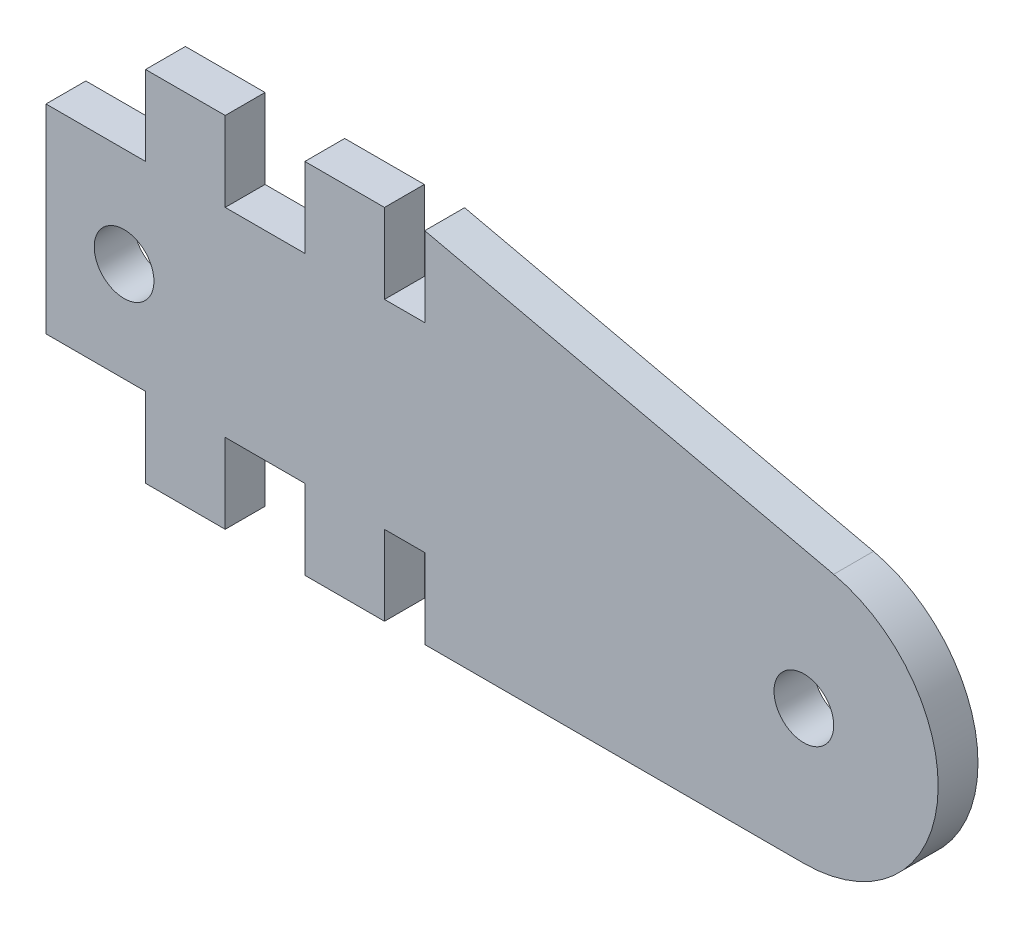
ISO-10303-21;
HEADER;
FILE_DESCRIPTION(('STEP AP214'),'2;1');
FILE_NAME('part.step','',(''),(''),'','','');
FILE_SCHEMA(('AUTOMOTIVE_DESIGN { 1 0 10303 214 1 1 1 1 }'));
ENDSEC;
DATA;
#1=APPLICATION_CONTEXT('core data for automotive mechanical design processes');
#2=APPLICATION_PROTOCOL_DEFINITION('international standard','automotive_design',2000,#1);
#3=PRODUCT_CONTEXT('',#1,'mechanical');
#4=PRODUCT('Part','Part','',(#3));
#5=PRODUCT_RELATED_PRODUCT_CATEGORY('part','',(#4));
#6=PRODUCT_DEFINITION_FORMATION('','',#4);
#7=PRODUCT_DEFINITION_CONTEXT('part definition',#1,'design');
#8=PRODUCT_DEFINITION('design','',#6,#7);
#9=PRODUCT_DEFINITION_SHAPE('','',#8);
#10=(LENGTH_UNIT() NAMED_UNIT(*) SI_UNIT(.MILLI.,.METRE.));
#11=(NAMED_UNIT(*) PLANE_ANGLE_UNIT() SI_UNIT($,.RADIAN.));
#12=(NAMED_UNIT(*) SI_UNIT($,.STERADIAN.) SOLID_ANGLE_UNIT());
#13=UNCERTAINTY_MEASURE_WITH_UNIT(LENGTH_MEASURE(1.E-05),#10,'distance_accuracy_value','');
#14=(GEOMETRIC_REPRESENTATION_CONTEXT(3) GLOBAL_UNCERTAINTY_ASSIGNED_CONTEXT((#13)) GLOBAL_UNIT_ASSIGNED_CONTEXT((#10,
#11,#12)) REPRESENTATION_CONTEXT('',''));
#15=CARTESIAN_POINT('',(0.,0.,0.));
#16=DIRECTION('',(0.,0.,1.));
#17=DIRECTION('',(1.,0.,0.));
#18=AXIS2_PLACEMENT_3D('',#15,#16,#17);
#19=CARTESIAN_POINT('',(38.05949585108,6.74534308282998,2.));
#20=DIRECTION('',(0.,0.,1.));
#21=DIRECTION('',(1.,0.,0.));
#22=AXIS2_PLACEMENT_3D('',#19,#20,#21);
#23=PLANE('',#22);
#24=CARTESIAN_POINT('',(3.92049009293526,8.99999999999998,2.));
#25=DIRECTION('',(0.,0.,1.));
#26=DIRECTION('',(1.,0.,0.));
#27=AXIS2_PLACEMENT_3D('',#24,#25,#26);
#28=CIRCLE('',#27,1.5);
#29=CARTESIAN_POINT('',(5.42049009293527,8.99999999999998,2.));
#30=VERTEX_POINT('',#29);
#31=EDGE_CURVE('E229',#30,#30,#28,.T.);
#32=ORIENTED_EDGE('',*,*,#31,.F.);
#33=EDGE_LOOP('',(#32));
#34=FACE_BOUND('',#33,.T.);
#35=DIRECTION('',(0.,1.,0.));
#36=VECTOR('',#35,1.);
#37=CARTESIAN_POINT('',(9.,0.,2.));
#38=LINE('',#37,#36);
#39=CARTESIAN_POINT('',(9.,0.,2.));
#40=VERTEX_POINT('',#39);
#41=CARTESIAN_POINT('',(9.,4.,2.));
#42=VERTEX_POINT('',#41);
#43=EDGE_CURVE('E272',#40,#42,#38,.T.);
#44=ORIENTED_EDGE('',*,*,#43,.T.);
#45=DIRECTION('',(1.,0.,0.));
#46=VECTOR('',#45,1.);
#47=CARTESIAN_POINT('',(9.,4.,2.));
#48=LINE('',#47,#46);
#49=CARTESIAN_POINT('',(13.,4.,2.));
#50=VERTEX_POINT('',#49);
#51=EDGE_CURVE('E140',#42,#50,#48,.T.);
#52=ORIENTED_EDGE('',*,*,#51,.T.);
#53=DIRECTION('',(0.,-1.,0.));
#54=VECTOR('',#53,1.);
#55=CARTESIAN_POINT('',(13.,4.,2.));
#56=LINE('',#55,#54);
#57=CARTESIAN_POINT('',(13.,0.,2.));
#58=VERTEX_POINT('',#57);
#59=EDGE_CURVE('E335',#50,#58,#56,.T.);
#60=ORIENTED_EDGE('',*,*,#59,.T.);
#61=DIRECTION('',(1.,0.,0.));
#62=VECTOR('',#61,1.);
#63=CARTESIAN_POINT('',(13.,0.,2.));
#64=LINE('',#63,#62);
#65=CARTESIAN_POINT('',(17.,0.,2.));
#66=VERTEX_POINT('',#65);
#67=EDGE_CURVE('E354',#58,#66,#64,.T.);
#68=ORIENTED_EDGE('',*,*,#67,.T.);
#69=DIRECTION('',(0.,1.,0.));
#70=VECTOR('',#69,1.);
#71=CARTESIAN_POINT('',(17.,0.,2.));
#72=LINE('',#71,#70);
#73=CARTESIAN_POINT('',(17.,4.,2.));
#74=VERTEX_POINT('',#73);
#75=EDGE_CURVE('E351',#66,#74,#72,.T.);
#76=ORIENTED_EDGE('',*,*,#75,.T.);
#77=DIRECTION('',(1.,0.,0.));
#78=VECTOR('',#77,1.);
#79=CARTESIAN_POINT('',(17.,4.,2.));
#80=LINE('',#79,#78);
#81=CARTESIAN_POINT('',(19.0215619335038,4.,2.));
#82=VERTEX_POINT('',#81);
#83=EDGE_CURVE('E353',#74,#82,#80,.T.);
#84=ORIENTED_EDGE('',*,*,#83,.T.);
#85=DIRECTION('',(0.,-1.,0.));
#86=VECTOR('',#85,1.);
#87=CARTESIAN_POINT('',(19.0215619335038,4.,2.));
#88=LINE('',#87,#86);
#89=CARTESIAN_POINT('',(19.0215619335038,0.,2.));
#90=VERTEX_POINT('',#89);
#91=EDGE_CURVE('E356',#82,#90,#88,.T.);
#92=ORIENTED_EDGE('',*,*,#91,.T.);
#93=DIRECTION('',(1.,0.,0.));
#94=VECTOR('',#93,1.);
#95=CARTESIAN_POINT('',(19.0215619335038,0.,2.));
#96=LINE('',#95,#94);
#97=CARTESIAN_POINT('',(38.05949585108,0.,2.));
#98=VERTEX_POINT('',#97);
#99=EDGE_CURVE('E362',#90,#98,#96,.T.);
#100=ORIENTED_EDGE('',*,*,#99,.T.);
#101=CARTESIAN_POINT('',(38.05949585108,6.74534308282998,2.));
#102=DIRECTION('',(0.,0.,1.));
#103=DIRECTION('',(1.,0.,0.));
#104=AXIS2_PLACEMENT_3D('',#101,#102,#103);
#105=CIRCLE('',#104,6.74534308282998);
#106=CARTESIAN_POINT('',(39.5575990260467,13.3222222958182,2.));
#107=VERTEX_POINT('',#106);
#108=EDGE_CURVE('E364',#98,#107,#105,.T.);
#109=ORIENTED_EDGE('',*,*,#108,.T.);
#110=DIRECTION('',(-0.97502515916936,0.22209443709099,0.));
#111=VECTOR('',#110,1.);
#112=CARTESIAN_POINT('',(19.0215619335039,17.9999883567818,2.));
#113=LINE('',#112,#111);
#114=CARTESIAN_POINT('',(19.0215619335039,17.9999883567818,2.));
#115=VERTEX_POINT('',#114);
#116=EDGE_CURVE('E366',#107,#115,#113,.T.);
#117=ORIENTED_EDGE('',*,*,#116,.T.);
#118=DIRECTION('',(0.,-1.,0.));
#119=VECTOR('',#118,1.);
#120=CARTESIAN_POINT('',(19.0215619335038,13.9999883567817,2.));
#121=LINE('',#120,#119);
#122=CARTESIAN_POINT('',(19.0215619335038,13.9999883567817,2.));
#123=VERTEX_POINT('',#122);
#124=EDGE_CURVE('E368',#115,#123,#121,.T.);
#125=ORIENTED_EDGE('',*,*,#124,.T.);
#126=DIRECTION('',(-1.,0.,0.));
#127=VECTOR('',#126,1.);
#128=CARTESIAN_POINT('',(17.,13.9999883567817,2.));
#129=LINE('',#128,#127);
#130=CARTESIAN_POINT('',(17.,13.9999883567817,2.));
#131=VERTEX_POINT('',#130);
#132=EDGE_CURVE('E370',#123,#131,#129,.T.);
#133=ORIENTED_EDGE('',*,*,#132,.T.);
#134=DIRECTION('',(0.,1.,0.));
#135=VECTOR('',#134,1.);
#136=CARTESIAN_POINT('',(17.,17.9999883567817,2.));
#137=LINE('',#136,#135);
#138=CARTESIAN_POINT('',(17.,17.9999883567817,2.));
#139=VERTEX_POINT('',#138);
#140=EDGE_CURVE('E372',#131,#139,#137,.T.);
#141=ORIENTED_EDGE('',*,*,#140,.T.);
#142=DIRECTION('',(-1.,0.,0.));
#143=VECTOR('',#142,1.);
#144=CARTESIAN_POINT('',(13.,17.9999883567817,2.));
#145=LINE('',#144,#143);
#146=CARTESIAN_POINT('',(13.,17.9999883567817,2.));
#147=VERTEX_POINT('',#146);
#148=EDGE_CURVE('E374',#139,#147,#145,.T.);
#149=ORIENTED_EDGE('',*,*,#148,.T.);
#150=DIRECTION('',(0.,-1.,0.));
#151=VECTOR('',#150,1.);
#152=CARTESIAN_POINT('',(13.,13.9999883567817,2.));
#153=LINE('',#152,#151);
#154=CARTESIAN_POINT('',(13.,13.9999883567817,2.));
#155=VERTEX_POINT('',#154);
#156=EDGE_CURVE('E376',#147,#155,#153,.T.);
#157=ORIENTED_EDGE('',*,*,#156,.T.);
#158=DIRECTION('',(-1.,0.,0.));
#159=VECTOR('',#158,1.);
#160=CARTESIAN_POINT('',(9.,13.9999883567817,2.));
#161=LINE('',#160,#159);
#162=CARTESIAN_POINT('',(9.,13.9999883567817,2.));
#163=VERTEX_POINT('',#162);
#164=EDGE_CURVE('E378',#155,#163,#161,.T.);
#165=ORIENTED_EDGE('',*,*,#164,.T.);
#166=DIRECTION('',(0.,1.,0.));
#167=VECTOR('',#166,1.);
#168=CARTESIAN_POINT('',(9.,17.9999883567817,2.));
#169=LINE('',#168,#167);
#170=CARTESIAN_POINT('',(9.,17.9999883567817,2.));
#171=VERTEX_POINT('',#170);
#172=EDGE_CURVE('E380',#163,#171,#169,.T.);
#173=ORIENTED_EDGE('',*,*,#172,.T.);
#174=DIRECTION('',(-1.,0.,0.));
#175=VECTOR('',#174,1.);
#176=CARTESIAN_POINT('',(5.,17.9999883567817,2.));
#177=LINE('',#176,#175);
#178=CARTESIAN_POINT('',(5.,17.9999883567817,2.));
#179=VERTEX_POINT('',#178);
#180=EDGE_CURVE('E382',#171,#179,#177,.T.);
#181=ORIENTED_EDGE('',*,*,#180,.T.);
#182=DIRECTION('',(0.,-1.,0.));
#183=VECTOR('',#182,1.);
#184=CARTESIAN_POINT('',(5.,13.9999883567817,2.));
#185=LINE('',#184,#183);
#186=CARTESIAN_POINT('',(5.,13.9999883567817,2.));
#187=VERTEX_POINT('',#186);
#188=EDGE_CURVE('E384',#179,#187,#185,.T.);
#189=ORIENTED_EDGE('',*,*,#188,.T.);
#190=DIRECTION('',(-1.,0.,0.));
#191=VECTOR('',#190,1.);
#192=CARTESIAN_POINT('',(5.,13.9999883567817,2.));
#193=LINE('',#192,#191);
#194=CARTESIAN_POINT('',(0.,13.9999883567817,2.));
#195=VERTEX_POINT('',#194);
#196=EDGE_CURVE('E386',#187,#195,#193,.T.);
#197=ORIENTED_EDGE('',*,*,#196,.T.);
#198=DIRECTION('',(0.,-1.,0.));
#199=VECTOR('',#198,1.);
#200=CARTESIAN_POINT('',(0.,13.9999883567817,2.));
#201=LINE('',#200,#199);
#202=CARTESIAN_POINT('',(0.,4.,2.));
#203=VERTEX_POINT('',#202);
#204=EDGE_CURVE('E207',#195,#203,#201,.T.);
#205=ORIENTED_EDGE('',*,*,#204,.T.);
#206=DIRECTION('',(1.,0.,0.));
#207=VECTOR('',#206,1.);
#208=CARTESIAN_POINT('',(0.,4.,2.));
#209=LINE('',#208,#207);
#210=CARTESIAN_POINT('',(5.,4.,2.));
#211=VERTEX_POINT('',#210);
#212=EDGE_CURVE('E201',#203,#211,#209,.T.);
#213=ORIENTED_EDGE('',*,*,#212,.T.);
#214=DIRECTION('',(0.,-1.,0.));
#215=VECTOR('',#214,1.);
#216=CARTESIAN_POINT('',(5.,4.,2.));
#217=LINE('',#216,#215);
#218=CARTESIAN_POINT('',(5.,0.,2.));
#219=VERTEX_POINT('',#218);
#220=EDGE_CURVE('E205',#211,#219,#217,.T.);
#221=ORIENTED_EDGE('',*,*,#220,.T.);
#222=DIRECTION('',(1.,0.,0.));
#223=VECTOR('',#222,1.);
#224=CARTESIAN_POINT('',(5.,0.,2.));
#225=LINE('',#224,#223);
#226=EDGE_CURVE('E49',#219,#40,#225,.T.);
#227=ORIENTED_EDGE('',*,*,#226,.T.);
#228=EDGE_LOOP('',(#44,#52,#60,#68,#76,#84,#92,#100,#109,#117,#125,#133,#141,#149,#157,#165,
#173,#181,#189,#197,#205,#213,#221,#227));
#229=FACE_BOUND('',#228,.T.);
#230=CARTESIAN_POINT('',(38.05949585108,6.74534308282998,2.));
#231=DIRECTION('',(0.,0.,1.));
#232=DIRECTION('',(1.,0.,0.));
#233=AXIS2_PLACEMENT_3D('',#230,#231,#232);
#234=CIRCLE('',#233,1.5);
#235=CARTESIAN_POINT('',(39.55949585108,6.74534308282998,2.));
#236=VERTEX_POINT('',#235);
#237=EDGE_CURVE('E429',#236,#236,#234,.T.);
#238=ORIENTED_EDGE('',*,*,#237,.F.);
#239=EDGE_LOOP('',(#238));
#240=FACE_BOUND('',#239,.T.);
#241=ADVANCED_FACE('F32',(#34,#229,#240),#23,.T.);
#242=CARTESIAN_POINT('',(38.05949585108,6.74534308282998,0.));
#243=DIRECTION('',(0.,0.,1.));
#244=DIRECTION('',(1.,0.,0.));
#245=AXIS2_PLACEMENT_3D('',#242,#243,#244);
#246=PLANE('',#245);
#247=CARTESIAN_POINT('',(3.92049009293526,8.99999999999998,0.));
#248=DIRECTION('',(0.,0.,1.));
#249=DIRECTION('',(1.,0.,0.));
#250=AXIS2_PLACEMENT_3D('',#247,#248,#249);
#251=CIRCLE('',#250,1.5);
#252=CARTESIAN_POINT('',(5.42049009293527,8.99999999999998,0.));
#253=VERTEX_POINT('',#252);
#254=EDGE_CURVE('E434',#253,#253,#251,.T.);
#255=ORIENTED_EDGE('',*,*,#254,.T.);
#256=EDGE_LOOP('',(#255));
#257=FACE_BOUND('',#256,.T.);
#258=DIRECTION('',(0.,1.,0.));
#259=VECTOR('',#258,1.);
#260=CARTESIAN_POINT('',(9.,0.,0.));
#261=LINE('',#260,#259);
#262=CARTESIAN_POINT('',(9.,0.,0.));
#263=VERTEX_POINT('',#262);
#264=CARTESIAN_POINT('',(9.,4.,0.));
#265=VERTEX_POINT('',#264);
#266=EDGE_CURVE('E225',#263,#265,#261,.T.);
#267=ORIENTED_EDGE('',*,*,#266,.F.);
#268=DIRECTION('',(1.,0.,0.));
#269=VECTOR('',#268,1.);
#270=CARTESIAN_POINT('',(5.,0.,0.));
#271=LINE('',#270,#269);
#272=CARTESIAN_POINT('',(5.,0.,0.));
#273=VERTEX_POINT('',#272);
#274=EDGE_CURVE('E132',#273,#263,#271,.T.);
#275=ORIENTED_EDGE('',*,*,#274,.F.);
#276=DIRECTION('',(0.,-1.,0.));
#277=VECTOR('',#276,1.);
#278=CARTESIAN_POINT('',(5.,4.,0.));
#279=LINE('',#278,#277);
#280=CARTESIAN_POINT('',(5.,4.,0.));
#281=VERTEX_POINT('',#280);
#282=EDGE_CURVE('E126',#281,#273,#279,.T.);
#283=ORIENTED_EDGE('',*,*,#282,.F.);
#284=DIRECTION('',(1.,0.,0.));
#285=VECTOR('',#284,1.);
#286=CARTESIAN_POINT('',(0.,4.,0.));
#287=LINE('',#286,#285);
#288=CARTESIAN_POINT('',(0.,4.,0.));
#289=VERTEX_POINT('',#288);
#290=EDGE_CURVE('E215',#289,#281,#287,.T.);
#291=ORIENTED_EDGE('',*,*,#290,.F.);
#292=DIRECTION('',(0.,-1.,0.));
#293=VECTOR('',#292,1.);
#294=CARTESIAN_POINT('',(0.,13.9999883567817,0.));
#295=LINE('',#294,#293);
#296=CARTESIAN_POINT('',(0.,13.9999883567817,0.));
#297=VERTEX_POINT('',#296);
#298=EDGE_CURVE('E267',#297,#289,#295,.T.);
#299=ORIENTED_EDGE('',*,*,#298,.F.);
#300=DIRECTION('',(-1.,0.,0.));
#301=VECTOR('',#300,1.);
#302=CARTESIAN_POINT('',(5.,13.9999883567817,0.));
#303=LINE('',#302,#301);
#304=CARTESIAN_POINT('',(5.,13.9999883567817,0.));
#305=VERTEX_POINT('',#304);
#306=EDGE_CURVE('E265',#305,#297,#303,.T.);
#307=ORIENTED_EDGE('',*,*,#306,.F.);
#308=DIRECTION('',(0.,-1.,0.));
#309=VECTOR('',#308,1.);
#310=CARTESIAN_POINT('',(5.,13.9999883567817,0.));
#311=LINE('',#310,#309);
#312=CARTESIAN_POINT('',(5.,17.9999883567817,0.));
#313=VERTEX_POINT('',#312);
#314=EDGE_CURVE('E263',#313,#305,#311,.T.);
#315=ORIENTED_EDGE('',*,*,#314,.F.);
#316=DIRECTION('',(-1.,0.,0.));
#317=VECTOR('',#316,1.);
#318=CARTESIAN_POINT('',(5.,17.9999883567817,0.));
#319=LINE('',#318,#317);
#320=CARTESIAN_POINT('',(9.,17.9999883567817,0.));
#321=VERTEX_POINT('',#320);
#322=EDGE_CURVE('E261',#321,#313,#319,.T.);
#323=ORIENTED_EDGE('',*,*,#322,.F.);
#324=DIRECTION('',(0.,1.,0.));
#325=VECTOR('',#324,1.);
#326=CARTESIAN_POINT('',(9.,17.9999883567817,0.));
#327=LINE('',#326,#325);
#328=CARTESIAN_POINT('',(9.,13.9999883567817,0.));
#329=VERTEX_POINT('',#328);
#330=EDGE_CURVE('E259',#329,#321,#327,.T.);
#331=ORIENTED_EDGE('',*,*,#330,.F.);
#332=DIRECTION('',(-1.,0.,0.));
#333=VECTOR('',#332,1.);
#334=CARTESIAN_POINT('',(9.,13.9999883567817,0.));
#335=LINE('',#334,#333);
#336=CARTESIAN_POINT('',(13.,13.9999883567817,0.));
#337=VERTEX_POINT('',#336);
#338=EDGE_CURVE('E257',#337,#329,#335,.T.);
#339=ORIENTED_EDGE('',*,*,#338,.F.);
#340=DIRECTION('',(0.,-1.,0.));
#341=VECTOR('',#340,1.);
#342=CARTESIAN_POINT('',(13.,13.9999883567817,0.));
#343=LINE('',#342,#341);
#344=CARTESIAN_POINT('',(13.,17.9999883567817,0.));
#345=VERTEX_POINT('',#344);
#346=EDGE_CURVE('E255',#345,#337,#343,.T.);
#347=ORIENTED_EDGE('',*,*,#346,.F.);
#348=DIRECTION('',(-1.,0.,0.));
#349=VECTOR('',#348,1.);
#350=CARTESIAN_POINT('',(13.,17.9999883567817,0.));
#351=LINE('',#350,#349);
#352=CARTESIAN_POINT('',(17.,17.9999883567817,0.));
#353=VERTEX_POINT('',#352);
#354=EDGE_CURVE('E253',#353,#345,#351,.T.);
#355=ORIENTED_EDGE('',*,*,#354,.F.);
#356=DIRECTION('',(0.,1.,0.));
#357=VECTOR('',#356,1.);
#358=CARTESIAN_POINT('',(17.,17.9999883567817,0.));
#359=LINE('',#358,#357);
#360=CARTESIAN_POINT('',(17.,13.9999883567817,0.));
#361=VERTEX_POINT('',#360);
#362=EDGE_CURVE('E251',#361,#353,#359,.T.);
#363=ORIENTED_EDGE('',*,*,#362,.F.);
#364=DIRECTION('',(-1.,0.,0.));
#365=VECTOR('',#364,1.);
#366=CARTESIAN_POINT('',(17.,13.9999883567817,0.));
#367=LINE('',#366,#365);
#368=CARTESIAN_POINT('',(19.0215619335038,13.9999883567817,0.));
#369=VERTEX_POINT('',#368);
#370=EDGE_CURVE('E249',#369,#361,#367,.T.);
#371=ORIENTED_EDGE('',*,*,#370,.F.);
#372=DIRECTION('',(0.,-1.,0.));
#373=VECTOR('',#372,1.);
#374=CARTESIAN_POINT('',(19.0215619335038,13.9999883567817,0.));
#375=LINE('',#374,#373);
#376=CARTESIAN_POINT('',(19.0215619335039,17.9999883567818,0.));
#377=VERTEX_POINT('',#376);
#378=EDGE_CURVE('E247',#377,#369,#375,.T.);
#379=ORIENTED_EDGE('',*,*,#378,.F.);
#380=DIRECTION('',(-0.97502515916936,0.22209443709099,0.));
#381=VECTOR('',#380,1.);
#382=CARTESIAN_POINT('',(19.0215619335039,17.9999883567818,0.));
#383=LINE('',#382,#381);
#384=CARTESIAN_POINT('',(39.5575990260467,13.3222222958182,0.));
#385=VERTEX_POINT('',#384);
#386=EDGE_CURVE('E245',#385,#377,#383,.T.);
#387=ORIENTED_EDGE('',*,*,#386,.F.);
#388=CARTESIAN_POINT('',(38.05949585108,6.74534308282998,0.));
#389=DIRECTION('',(0.,0.,1.));
#390=DIRECTION('',(1.,0.,0.));
#391=AXIS2_PLACEMENT_3D('',#388,#389,#390);
#392=CIRCLE('',#391,6.74534308282998);
#393=CARTESIAN_POINT('',(38.05949585108,0.,0.));
#394=VERTEX_POINT('',#393);
#395=EDGE_CURVE('E243',#394,#385,#392,.T.);
#396=ORIENTED_EDGE('',*,*,#395,.F.);
#397=DIRECTION('',(1.,0.,0.));
#398=VECTOR('',#397,1.);
#399=CARTESIAN_POINT('',(19.0215619335038,0.,0.));
#400=LINE('',#399,#398);
#401=CARTESIAN_POINT('',(19.0215619335038,0.,0.));
#402=VERTEX_POINT('',#401);
#403=EDGE_CURVE('E241',#402,#394,#400,.T.);
#404=ORIENTED_EDGE('',*,*,#403,.F.);
#405=DIRECTION('',(0.,-1.,0.));
#406=VECTOR('',#405,1.);
#407=CARTESIAN_POINT('',(19.0215619335038,4.,0.));
#408=LINE('',#407,#406);
#409=CARTESIAN_POINT('',(19.0215619335038,4.,0.));
#410=VERTEX_POINT('',#409);
#411=EDGE_CURVE('E239',#410,#402,#408,.T.);
#412=ORIENTED_EDGE('',*,*,#411,.F.);
#413=DIRECTION('',(1.,0.,0.));
#414=VECTOR('',#413,1.);
#415=CARTESIAN_POINT('',(17.,4.,0.));
#416=LINE('',#415,#414);
#417=CARTESIAN_POINT('',(17.,4.,0.));
#418=VERTEX_POINT('',#417);
#419=EDGE_CURVE('E237',#418,#410,#416,.T.);
#420=ORIENTED_EDGE('',*,*,#419,.F.);
#421=DIRECTION('',(0.,1.,0.));
#422=VECTOR('',#421,1.);
#423=CARTESIAN_POINT('',(17.,0.,0.));
#424=LINE('',#423,#422);
#425=CARTESIAN_POINT('',(17.,0.,0.));
#426=VERTEX_POINT('',#425);
#427=EDGE_CURVE('E235',#426,#418,#424,.T.);
#428=ORIENTED_EDGE('',*,*,#427,.F.);
#429=DIRECTION('',(1.,0.,0.));
#430=VECTOR('',#429,1.);
#431=CARTESIAN_POINT('',(13.,0.,0.));
#432=LINE('',#431,#430);
#433=CARTESIAN_POINT('',(13.,0.,0.));
#434=VERTEX_POINT('',#433);
#435=EDGE_CURVE('E233',#434,#426,#432,.T.);
#436=ORIENTED_EDGE('',*,*,#435,.F.);
#437=DIRECTION('',(0.,-1.,0.));
#438=VECTOR('',#437,1.);
#439=CARTESIAN_POINT('',(13.,4.,0.));
#440=LINE('',#439,#438);
#441=CARTESIAN_POINT('',(13.,4.,0.));
#442=VERTEX_POINT('',#441);
#443=EDGE_CURVE('E231',#442,#434,#440,.T.);
#444=ORIENTED_EDGE('',*,*,#443,.F.);
#445=DIRECTION('',(1.,0.,0.));
#446=VECTOR('',#445,1.);
#447=CARTESIAN_POINT('',(9.,4.,0.));
#448=LINE('',#447,#446);
#449=EDGE_CURVE('E228',#265,#442,#448,.T.);
#450=ORIENTED_EDGE('',*,*,#449,.F.);
#451=EDGE_LOOP('',(#267,#275,#283,#291,#299,#307,#315,#323,#331,#339,#347,#355,#363,#371,#379,
#387,#396,#404,#412,#420,#428,#436,#444,#450));
#452=FACE_BOUND('',#451,.T.);
#453=CARTESIAN_POINT('',(38.05949585108,6.74534308282998,0.));
#454=DIRECTION('',(0.,0.,1.));
#455=DIRECTION('',(1.,0.,0.));
#456=AXIS2_PLACEMENT_3D('',#453,#454,#455);
#457=CIRCLE('',#456,1.5);
#458=CARTESIAN_POINT('',(39.55949585108,6.74534308282998,0.));
#459=VERTEX_POINT('',#458);
#460=EDGE_CURVE('E432',#459,#459,#457,.T.);
#461=ORIENTED_EDGE('',*,*,#460,.T.);
#462=EDGE_LOOP('',(#461));
#463=FACE_BOUND('',#462,.T.);
#464=ADVANCED_FACE('F339',(#257,#452,#463),#246,.F.);
#465=CARTESIAN_POINT('',(9.,0.,2.));
#466=DIRECTION('',(-1.,0.,0.));
#467=DIRECTION('',(0.,0.,1.));
#468=AXIS2_PLACEMENT_3D('',#465,#466,#467);
#469=PLANE('',#468);
#470=ORIENTED_EDGE('',*,*,#266,.T.);
#471=DIRECTION('',(0.,0.,-1.));
#472=VECTOR('',#471,1.);
#473=CARTESIAN_POINT('',(9.,4.,2.));
#474=LINE('',#473,#472);
#475=EDGE_CURVE('E11',#42,#265,#474,.T.);
#476=ORIENTED_EDGE('',*,*,#475,.F.);
#477=ORIENTED_EDGE('',*,*,#43,.F.);
#478=DIRECTION('',(0.,0.,-1.));
#479=VECTOR('',#478,1.);
#480=CARTESIAN_POINT('',(9.,0.,2.));
#481=LINE('',#480,#479);
#482=EDGE_CURVE('E221',#40,#263,#481,.T.);
#483=ORIENTED_EDGE('',*,*,#482,.T.);
#484=EDGE_LOOP('',(#470,#476,#477,#483));
#485=FACE_BOUND('',#484,.T.);
#486=ADVANCED_FACE('F34',(#485),#469,.F.);
#487=CARTESIAN_POINT('',(9.,4.,2.));
#488=DIRECTION('',(0.,1.,0.));
#489=DIRECTION('',(0.,0.,1.));
#490=AXIS2_PLACEMENT_3D('',#487,#488,#489);
#491=PLANE('',#490);
#492=ORIENTED_EDGE('',*,*,#449,.T.);
#493=DIRECTION('',(0.,0.,-1.));
#494=VECTOR('',#493,1.);
#495=CARTESIAN_POINT('',(13.,4.,2.));
#496=LINE('',#495,#494);
#497=EDGE_CURVE('E41',#50,#442,#496,.T.);
#498=ORIENTED_EDGE('',*,*,#497,.F.);
#499=ORIENTED_EDGE('',*,*,#51,.F.);
#500=ORIENTED_EDGE('',*,*,#475,.T.);
#501=EDGE_LOOP('',(#492,#498,#499,#500));
#502=FACE_BOUND('',#501,.T.);
#503=ADVANCED_FACE('F647',(#502),#491,.F.);
#504=CARTESIAN_POINT('',(13.,4.,2.));
#505=DIRECTION('',(1.,0.,0.));
#506=DIRECTION('',(0.,1.,0.));
#507=AXIS2_PLACEMENT_3D('',#504,#505,#506);
#508=PLANE('',#507);
#509=ORIENTED_EDGE('',*,*,#443,.T.);
#510=DIRECTION('',(0.,0.,-1.));
#511=VECTOR('',#510,1.);
#512=CARTESIAN_POINT('',(13.,0.,2.));
#513=LINE('',#512,#511);
#514=EDGE_CURVE('E327',#58,#434,#513,.T.);
#515=ORIENTED_EDGE('',*,*,#514,.F.);
#516=ORIENTED_EDGE('',*,*,#59,.F.);
#517=ORIENTED_EDGE('',*,*,#497,.T.);
#518=EDGE_LOOP('',(#509,#515,#516,#517));
#519=FACE_BOUND('',#518,.T.);
#520=ADVANCED_FACE('F333',(#519),#508,.F.);
#521=CARTESIAN_POINT('',(13.,0.,2.));
#522=DIRECTION('',(0.,1.,0.));
#523=DIRECTION('',(-1.,0.,0.));
#524=AXIS2_PLACEMENT_3D('',#521,#522,#523);
#525=PLANE('',#524);
#526=ORIENTED_EDGE('',*,*,#435,.T.);
#527=DIRECTION('',(0.,0.,-1.));
#528=VECTOR('',#527,1.);
#529=CARTESIAN_POINT('',(17.,0.,2.));
#530=LINE('',#529,#528);
#531=EDGE_CURVE('E324',#66,#426,#530,.T.);
#532=ORIENTED_EDGE('',*,*,#531,.F.);
#533=ORIENTED_EDGE('',*,*,#67,.F.);
#534=ORIENTED_EDGE('',*,*,#514,.T.);
#535=EDGE_LOOP('',(#526,#532,#533,#534));
#536=FACE_BOUND('',#535,.T.);
#537=ADVANCED_FACE('F345',(#536),#525,.F.);
#538=CARTESIAN_POINT('',(17.,0.,2.));
#539=DIRECTION('',(-1.,0.,0.));
#540=DIRECTION('',(0.,0.,1.));
#541=AXIS2_PLACEMENT_3D('',#538,#539,#540);
#542=PLANE('',#541);
#543=ORIENTED_EDGE('',*,*,#427,.T.);
#544=DIRECTION('',(0.,0.,-1.));
#545=VECTOR('',#544,1.);
#546=CARTESIAN_POINT('',(17.,4.,2.));
#547=LINE('',#546,#545);
#548=EDGE_CURVE('E321',#74,#418,#547,.T.);
#549=ORIENTED_EDGE('',*,*,#548,.F.);
#550=ORIENTED_EDGE('',*,*,#75,.F.);
#551=ORIENTED_EDGE('',*,*,#531,.T.);
#552=EDGE_LOOP('',(#543,#549,#550,#551));
#553=FACE_BOUND('',#552,.T.);
#554=ADVANCED_FACE('F349',(#553),#542,.F.);
#555=CARTESIAN_POINT('',(17.,4.,2.));
#556=DIRECTION('',(0.,1.,0.));
#557=DIRECTION('',(0.,0.,1.));
#558=AXIS2_PLACEMENT_3D('',#555,#556,#557);
#559=PLANE('',#558);
#560=ORIENTED_EDGE('',*,*,#419,.T.);
#561=DIRECTION('',(0.,0.,-1.));
#562=VECTOR('',#561,1.);
#563=CARTESIAN_POINT('',(19.0215619335038,4.,2.));
#564=LINE('',#563,#562);
#565=EDGE_CURVE('E318',#82,#410,#564,.T.);
#566=ORIENTED_EDGE('',*,*,#565,.F.);
#567=ORIENTED_EDGE('',*,*,#83,.F.);
#568=ORIENTED_EDGE('',*,*,#548,.T.);
#569=EDGE_LOOP('',(#560,#566,#567,#568));
#570=FACE_BOUND('',#569,.T.);
#571=ADVANCED_FACE('F612',(#570),#559,.F.);
#572=CARTESIAN_POINT('',(19.0215619335038,4.,2.));
#573=DIRECTION('',(1.,0.,0.));
#574=DIRECTION('',(0.,0.,-1.));
#575=AXIS2_PLACEMENT_3D('',#572,#573,#574);
#576=PLANE('',#575);
#577=ORIENTED_EDGE('',*,*,#411,.T.);
#578=DIRECTION('',(0.,0.,-1.));
#579=VECTOR('',#578,1.);
#580=CARTESIAN_POINT('',(19.0215619335038,0.,2.));
#581=LINE('',#580,#579);
#582=EDGE_CURVE('E315',#90,#402,#581,.T.);
#583=ORIENTED_EDGE('',*,*,#582,.F.);
#584=ORIENTED_EDGE('',*,*,#91,.F.);
#585=ORIENTED_EDGE('',*,*,#565,.T.);
#586=EDGE_LOOP('',(#577,#583,#584,#585));
#587=FACE_BOUND('',#586,.T.);
#588=ADVANCED_FACE('F602',(#587),#576,.F.);
#589=CARTESIAN_POINT('',(19.0215619335038,0.,2.));
#590=DIRECTION('',(0.,1.,0.));
#591=DIRECTION('',(0.,0.,1.));
#592=AXIS2_PLACEMENT_3D('',#589,#590,#591);
#593=PLANE('',#592);
#594=ORIENTED_EDGE('',*,*,#403,.T.);
#595=DIRECTION('',(0.,0.,-1.));
#596=VECTOR('',#595,1.);
#597=CARTESIAN_POINT('',(38.05949585108,0.,2.));
#598=LINE('',#597,#596);
#599=EDGE_CURVE('E312',#98,#394,#598,.T.);
#600=ORIENTED_EDGE('',*,*,#599,.F.);
#601=ORIENTED_EDGE('',*,*,#99,.F.);
#602=ORIENTED_EDGE('',*,*,#582,.T.);
#603=EDGE_LOOP('',(#594,#600,#601,#602));
#604=FACE_BOUND('',#603,.T.);
#605=ADVANCED_FACE('F592',(#604),#593,.F.);
#606=CARTESIAN_POINT('',(38.05949585108,6.74534308282998,2.));
#607=DIRECTION('',(0.,0.,-1.));
#608=DIRECTION('',(-1.,0.,0.));
#609=AXIS2_PLACEMENT_3D('',#606,#607,#608);
#610=CYLINDRICAL_SURFACE('',#609,6.74534308282998);
#611=ORIENTED_EDGE('',*,*,#395,.T.);
#612=DIRECTION('',(0.,0.,-1.));
#613=VECTOR('',#612,1.);
#614=CARTESIAN_POINT('',(39.5575990260467,13.3222222958182,2.));
#615=LINE('',#614,#613);
#616=EDGE_CURVE('E309',#107,#385,#615,.T.);
#617=ORIENTED_EDGE('',*,*,#616,.F.);
#618=ORIENTED_EDGE('',*,*,#108,.F.);
#619=ORIENTED_EDGE('',*,*,#599,.T.);
#620=EDGE_LOOP('',(#611,#617,#618,#619));
#621=FACE_BOUND('',#620,.T.);
#622=ADVANCED_FACE('F582',(#621),#610,.T.);
#623=CARTESIAN_POINT('',(19.0215619335039,17.9999883567818,2.));
#624=DIRECTION('',(-0.22209443709099,-0.97502515916936,0.));
#625=DIRECTION('',(0.97502515916936,-0.22209443709099,0.));
#626=AXIS2_PLACEMENT_3D('',#623,#624,#625);
#627=PLANE('',#626);
#628=ORIENTED_EDGE('',*,*,#386,.T.);
#629=DIRECTION('',(0.,0.,-1.));
#630=VECTOR('',#629,1.);
#631=CARTESIAN_POINT('',(19.0215619335039,17.9999883567818,2.));
#632=LINE('',#631,#630);
#633=EDGE_CURVE('E306',#115,#377,#632,.T.);
#634=ORIENTED_EDGE('',*,*,#633,.F.);
#635=ORIENTED_EDGE('',*,*,#116,.F.);
#636=ORIENTED_EDGE('',*,*,#616,.T.);
#637=EDGE_LOOP('',(#628,#634,#635,#636));
#638=FACE_BOUND('',#637,.T.);
#639=ADVANCED_FACE('F572',(#638),#627,.F.);
#640=CARTESIAN_POINT('',(19.0215619335038,13.9999883567817,2.));
#641=DIRECTION('',(1.,0.,0.));
#642=DIRECTION('',(0.,1.,0.));
#643=AXIS2_PLACEMENT_3D('',#640,#641,#642);
#644=PLANE('',#643);
#645=ORIENTED_EDGE('',*,*,#378,.T.);
#646=DIRECTION('',(0.,0.,-1.));
#647=VECTOR('',#646,1.);
#648=CARTESIAN_POINT('',(19.0215619335038,13.9999883567817,2.));
#649=LINE('',#648,#647);
#650=EDGE_CURVE('E303',#123,#369,#649,.T.);
#651=ORIENTED_EDGE('',*,*,#650,.F.);
#652=ORIENTED_EDGE('',*,*,#124,.F.);
#653=ORIENTED_EDGE('',*,*,#633,.T.);
#654=EDGE_LOOP('',(#645,#651,#652,#653));
#655=FACE_BOUND('',#654,.T.);
#656=ADVANCED_FACE('F562',(#655),#644,.F.);
#657=CARTESIAN_POINT('',(17.,13.9999883567817,2.));
#658=DIRECTION('',(0.,-1.,0.));
#659=DIRECTION('',(0.,0.,-1.));
#660=AXIS2_PLACEMENT_3D('',#657,#658,#659);
#661=PLANE('',#660);
#662=ORIENTED_EDGE('',*,*,#370,.T.);
#663=DIRECTION('',(0.,0.,-1.));
#664=VECTOR('',#663,1.);
#665=CARTESIAN_POINT('',(17.,13.9999883567817,2.));
#666=LINE('',#665,#664);
#667=EDGE_CURVE('E300',#131,#361,#666,.T.);
#668=ORIENTED_EDGE('',*,*,#667,.F.);
#669=ORIENTED_EDGE('',*,*,#132,.F.);
#670=ORIENTED_EDGE('',*,*,#650,.T.);
#671=EDGE_LOOP('',(#662,#668,#669,#670));
#672=FACE_BOUND('',#671,.T.);
#673=ADVANCED_FACE('F552',(#672),#661,.F.);
#674=CARTESIAN_POINT('',(17.,17.9999883567817,2.));
#675=DIRECTION('',(-1.,0.,0.));
#676=DIRECTION('',(0.,-1.,0.));
#677=AXIS2_PLACEMENT_3D('',#674,#675,#676);
#678=PLANE('',#677);
#679=ORIENTED_EDGE('',*,*,#362,.T.);
#680=DIRECTION('',(0.,0.,-1.));
#681=VECTOR('',#680,1.);
#682=CARTESIAN_POINT('',(17.,17.9999883567817,2.));
#683=LINE('',#682,#681);
#684=EDGE_CURVE('E297',#139,#353,#683,.T.);
#685=ORIENTED_EDGE('',*,*,#684,.F.);
#686=ORIENTED_EDGE('',*,*,#140,.F.);
#687=ORIENTED_EDGE('',*,*,#667,.T.);
#688=EDGE_LOOP('',(#679,#685,#686,#687));
#689=FACE_BOUND('',#688,.T.);
#690=ADVANCED_FACE('F542',(#689),#678,.F.);
#691=CARTESIAN_POINT('',(13.,17.9999883567817,2.));
#692=DIRECTION('',(0.,-1.,0.));
#693=DIRECTION('',(0.,0.,-1.));
#694=AXIS2_PLACEMENT_3D('',#691,#692,#693);
#695=PLANE('',#694);
#696=ORIENTED_EDGE('',*,*,#354,.T.);
#697=DIRECTION('',(0.,0.,-1.));
#698=VECTOR('',#697,1.);
#699=CARTESIAN_POINT('',(13.,17.9999883567817,2.));
#700=LINE('',#699,#698);
#701=EDGE_CURVE('E294',#147,#345,#700,.T.);
#702=ORIENTED_EDGE('',*,*,#701,.F.);
#703=ORIENTED_EDGE('',*,*,#148,.F.);
#704=ORIENTED_EDGE('',*,*,#684,.T.);
#705=EDGE_LOOP('',(#696,#702,#703,#704));
#706=FACE_BOUND('',#705,.T.);
#707=ADVANCED_FACE('F532',(#706),#695,.F.);
#708=CARTESIAN_POINT('',(13.,13.9999883567817,2.));
#709=DIRECTION('',(1.,0.,0.));
#710=DIRECTION('',(0.,0.,-1.));
#711=AXIS2_PLACEMENT_3D('',#708,#709,#710);
#712=PLANE('',#711);
#713=ORIENTED_EDGE('',*,*,#346,.T.);
#714=DIRECTION('',(0.,0.,-1.));
#715=VECTOR('',#714,1.);
#716=CARTESIAN_POINT('',(13.,13.9999883567817,2.));
#717=LINE('',#716,#715);
#718=EDGE_CURVE('E291',#155,#337,#717,.T.);
#719=ORIENTED_EDGE('',*,*,#718,.F.);
#720=ORIENTED_EDGE('',*,*,#156,.F.);
#721=ORIENTED_EDGE('',*,*,#701,.T.);
#722=EDGE_LOOP('',(#713,#719,#720,#721));
#723=FACE_BOUND('',#722,.T.);
#724=ADVANCED_FACE('F522',(#723),#712,.F.);
#725=CARTESIAN_POINT('',(9.,13.9999883567817,2.));
#726=DIRECTION('',(0.,-1.,0.));
#727=DIRECTION('',(0.,0.,-1.));
#728=AXIS2_PLACEMENT_3D('',#725,#726,#727);
#729=PLANE('',#728);
#730=ORIENTED_EDGE('',*,*,#338,.T.);
#731=DIRECTION('',(0.,0.,-1.));
#732=VECTOR('',#731,1.);
#733=CARTESIAN_POINT('',(9.,13.9999883567817,2.));
#734=LINE('',#733,#732);
#735=EDGE_CURVE('E288',#163,#329,#734,.T.);
#736=ORIENTED_EDGE('',*,*,#735,.F.);
#737=ORIENTED_EDGE('',*,*,#164,.F.);
#738=ORIENTED_EDGE('',*,*,#718,.T.);
#739=EDGE_LOOP('',(#730,#736,#737,#738));
#740=FACE_BOUND('',#739,.T.);
#741=ADVANCED_FACE('F512',(#740),#729,.F.);
#742=CARTESIAN_POINT('',(9.,17.9999883567817,2.));
#743=DIRECTION('',(-1.,0.,0.));
#744=DIRECTION('',(0.,0.,1.));
#745=AXIS2_PLACEMENT_3D('',#742,#743,#744);
#746=PLANE('',#745);
#747=ORIENTED_EDGE('',*,*,#330,.T.);
#748=DIRECTION('',(0.,0.,-1.));
#749=VECTOR('',#748,1.);
#750=CARTESIAN_POINT('',(9.,17.9999883567817,2.));
#751=LINE('',#750,#749);
#752=EDGE_CURVE('E285',#171,#321,#751,.T.);
#753=ORIENTED_EDGE('',*,*,#752,.F.);
#754=ORIENTED_EDGE('',*,*,#172,.F.);
#755=ORIENTED_EDGE('',*,*,#735,.T.);
#756=EDGE_LOOP('',(#747,#753,#754,#755));
#757=FACE_BOUND('',#756,.T.);
#758=ADVANCED_FACE('F502',(#757),#746,.F.);
#759=CARTESIAN_POINT('',(5.,17.9999883567817,2.));
#760=DIRECTION('',(0.,-1.,0.));
#761=DIRECTION('',(0.,0.,-1.));
#762=AXIS2_PLACEMENT_3D('',#759,#760,#761);
#763=PLANE('',#762);
#764=ORIENTED_EDGE('',*,*,#322,.T.);
#765=DIRECTION('',(0.,0.,-1.));
#766=VECTOR('',#765,1.);
#767=CARTESIAN_POINT('',(5.,17.9999883567817,2.));
#768=LINE('',#767,#766);
#769=EDGE_CURVE('E282',#179,#313,#768,.T.);
#770=ORIENTED_EDGE('',*,*,#769,.F.);
#771=ORIENTED_EDGE('',*,*,#180,.F.);
#772=ORIENTED_EDGE('',*,*,#752,.T.);
#773=EDGE_LOOP('',(#764,#770,#771,#772));
#774=FACE_BOUND('',#773,.T.);
#775=ADVANCED_FACE('F492',(#774),#763,.F.);
#776=CARTESIAN_POINT('',(5.,13.9999883567817,2.));
#777=DIRECTION('',(1.,0.,0.));
#778=DIRECTION('',(0.,0.,-1.));
#779=AXIS2_PLACEMENT_3D('',#776,#777,#778);
#780=PLANE('',#779);
#781=ORIENTED_EDGE('',*,*,#314,.T.);
#782=DIRECTION('',(0.,0.,-1.));
#783=VECTOR('',#782,1.);
#784=CARTESIAN_POINT('',(5.,13.9999883567817,2.));
#785=LINE('',#784,#783);
#786=EDGE_CURVE('E279',#187,#305,#785,.T.);
#787=ORIENTED_EDGE('',*,*,#786,.F.);
#788=ORIENTED_EDGE('',*,*,#188,.F.);
#789=ORIENTED_EDGE('',*,*,#769,.T.);
#790=EDGE_LOOP('',(#781,#787,#788,#789));
#791=FACE_BOUND('',#790,.T.);
#792=ADVANCED_FACE('F483',(#791),#780,.F.);
#793=CARTESIAN_POINT('',(5.,13.9999883567817,2.));
#794=DIRECTION('',(0.,-1.,0.));
#795=DIRECTION('',(0.,0.,-1.));
#796=AXIS2_PLACEMENT_3D('',#793,#794,#795);
#797=PLANE('',#796);
#798=ORIENTED_EDGE('',*,*,#306,.T.);
#799=DIRECTION('',(0.,0.,-1.));
#800=VECTOR('',#799,1.);
#801=CARTESIAN_POINT('',(0.,13.9999883567817,2.));
#802=LINE('',#801,#800);
#803=EDGE_CURVE('E276',#195,#297,#802,.T.);
#804=ORIENTED_EDGE('',*,*,#803,.F.);
#805=ORIENTED_EDGE('',*,*,#196,.F.);
#806=ORIENTED_EDGE('',*,*,#786,.T.);
#807=EDGE_LOOP('',(#798,#804,#805,#806));
#808=FACE_BOUND('',#807,.T.);
#809=ADVANCED_FACE('F392',(#808),#797,.F.);
#810=CARTESIAN_POINT('',(0.,13.9999883567817,2.));
#811=DIRECTION('',(1.,0.,0.));
#812=DIRECTION('',(0.,1.,0.));
#813=AXIS2_PLACEMENT_3D('',#810,#811,#812);
#814=PLANE('',#813);
#815=ORIENTED_EDGE('',*,*,#298,.T.);
#816=DIRECTION('',(0.,0.,-1.));
#817=VECTOR('',#816,1.);
#818=CARTESIAN_POINT('',(0.,4.,2.));
#819=LINE('',#818,#817);
#820=EDGE_CURVE('E216',#203,#289,#819,.T.);
#821=ORIENTED_EDGE('',*,*,#820,.F.);
#822=ORIENTED_EDGE('',*,*,#204,.F.);
#823=ORIENTED_EDGE('',*,*,#803,.T.);
#824=EDGE_LOOP('',(#815,#821,#822,#823));
#825=FACE_BOUND('',#824,.T.);
#826=ADVANCED_FACE('F396',(#825),#814,.F.);
#827=CARTESIAN_POINT('',(0.,4.,2.));
#828=DIRECTION('',(0.,1.,0.));
#829=DIRECTION('',(0.,0.,1.));
#830=AXIS2_PLACEMENT_3D('',#827,#828,#829);
#831=PLANE('',#830);
#832=ORIENTED_EDGE('',*,*,#290,.T.);
#833=DIRECTION('',(0.,0.,-1.));
#834=VECTOR('',#833,1.);
#835=CARTESIAN_POINT('',(5.,4.,2.));
#836=LINE('',#835,#834);
#837=EDGE_CURVE('E212',#211,#281,#836,.T.);
#838=ORIENTED_EDGE('',*,*,#837,.F.);
#839=ORIENTED_EDGE('',*,*,#212,.F.);
#840=ORIENTED_EDGE('',*,*,#820,.T.);
#841=EDGE_LOOP('',(#832,#838,#839,#840));
#842=FACE_BOUND('',#841,.T.);
#843=ADVANCED_FACE('F213',(#842),#831,.F.);
#844=CARTESIAN_POINT('',(5.,4.,2.));
#845=DIRECTION('',(1.,0.,0.));
#846=DIRECTION('',(0.,0.,-1.));
#847=AXIS2_PLACEMENT_3D('',#844,#845,#846);
#848=PLANE('',#847);
#849=ORIENTED_EDGE('',*,*,#282,.T.);
#850=DIRECTION('',(0.,0.,-1.));
#851=VECTOR('',#850,1.);
#852=CARTESIAN_POINT('',(5.,0.,2.));
#853=LINE('',#852,#851);
#854=EDGE_CURVE('E217',#219,#273,#853,.T.);
#855=ORIENTED_EDGE('',*,*,#854,.F.);
#856=ORIENTED_EDGE('',*,*,#220,.F.);
#857=ORIENTED_EDGE('',*,*,#837,.T.);
#858=EDGE_LOOP('',(#849,#855,#856,#857));
#859=FACE_BOUND('',#858,.T.);
#860=ADVANCED_FACE('F219',(#859),#848,.F.);
#861=CARTESIAN_POINT('',(5.,0.,2.));
#862=DIRECTION('',(0.,1.,0.));
#863=DIRECTION('',(0.,0.,1.));
#864=AXIS2_PLACEMENT_3D('',#861,#862,#863);
#865=PLANE('',#864);
#866=ORIENTED_EDGE('',*,*,#274,.T.);
#867=ORIENTED_EDGE('',*,*,#482,.F.);
#868=ORIENTED_EDGE('',*,*,#226,.F.);
#869=ORIENTED_EDGE('',*,*,#854,.T.);
#870=EDGE_LOOP('',(#866,#867,#868,#869));
#871=FACE_BOUND('',#870,.T.);
#872=ADVANCED_FACE('F400',(#871),#865,.F.);
#873=CARTESIAN_POINT('',(3.92049009293526,8.99999999999998,2.));
#874=DIRECTION('',(0.,0.,-1.));
#875=DIRECTION('',(-1.,0.,0.));
#876=AXIS2_PLACEMENT_3D('',#873,#874,#875);
#877=CYLINDRICAL_SURFACE('',#876,1.5);
#878=ORIENTED_EDGE('',*,*,#31,.T.);
#879=EDGE_LOOP('',(#878));
#880=FACE_BOUND('',#879,.T.);
#881=ORIENTED_EDGE('',*,*,#254,.F.);
#882=EDGE_LOOP('',(#881));
#883=FACE_BOUND('',#882,.T.);
#884=ADVANCED_FACE('F402',(#880,#883),#877,.F.);
#885=CARTESIAN_POINT('',(38.05949585108,6.74534308282998,2.));
#886=DIRECTION('',(0.,0.,-1.));
#887=DIRECTION('',(-1.,0.,0.));
#888=AXIS2_PLACEMENT_3D('',#885,#886,#887);
#889=CYLINDRICAL_SURFACE('',#888,1.5);
#890=ORIENTED_EDGE('',*,*,#237,.T.);
#891=EDGE_LOOP('',(#890));
#892=FACE_BOUND('',#891,.T.);
#893=ORIENTED_EDGE('',*,*,#460,.F.);
#894=EDGE_LOOP('',(#893));
#895=FACE_BOUND('',#894,.T.);
#896=ADVANCED_FACE('F408',(#892,#895),#889,.F.);
#897=CLOSED_SHELL('',(#241,#464,#486,#503,#520,#537,#554,#571,#588,#605,#622,#639,#656,#673,
#690,#707,#724,#741,#758,#775,#792,#809,#826,#843,#860,#872,#884,#896));
#898=MANIFOLD_SOLID_BREP('B2',#897);
#899=ADVANCED_BREP_SHAPE_REPRESENTATION('',(#18,#898),#14);
#900=SHAPE_DEFINITION_REPRESENTATION(#9,#899);
ENDSEC;
END-ISO-10303-21;
